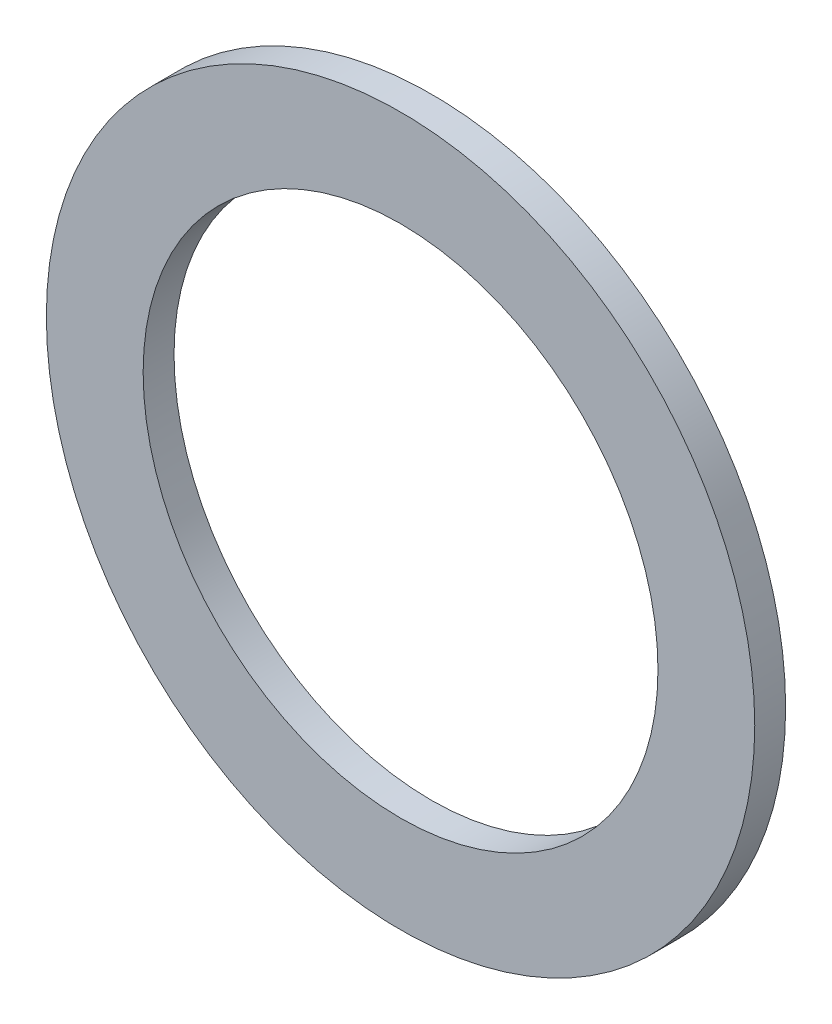
ISO-10303-21;
HEADER;
FILE_DESCRIPTION(('STEP AP214'),'2;1');
FILE_NAME('part.step','',(''),(''),'','','');
FILE_SCHEMA(('AUTOMOTIVE_DESIGN { 1 0 10303 214 1 1 1 1 }'));
ENDSEC;
DATA;
#1=APPLICATION_CONTEXT('core data for automotive mechanical design processes');
#2=APPLICATION_PROTOCOL_DEFINITION('international standard','automotive_design',2000,#1);
#3=PRODUCT_CONTEXT('',#1,'mechanical');
#4=PRODUCT('Part','Part','',(#3));
#5=PRODUCT_RELATED_PRODUCT_CATEGORY('part','',(#4));
#6=PRODUCT_DEFINITION_FORMATION('','',#4);
#7=PRODUCT_DEFINITION_CONTEXT('part definition',#1,'design');
#8=PRODUCT_DEFINITION('design','',#6,#7);
#9=PRODUCT_DEFINITION_SHAPE('','',#8);
#10=(LENGTH_UNIT() NAMED_UNIT(*) SI_UNIT(.MILLI.,.METRE.));
#11=(NAMED_UNIT(*) PLANE_ANGLE_UNIT() SI_UNIT($,.RADIAN.));
#12=(NAMED_UNIT(*) SI_UNIT($,.STERADIAN.) SOLID_ANGLE_UNIT());
#13=UNCERTAINTY_MEASURE_WITH_UNIT(LENGTH_MEASURE(1.E-05),#10,'distance_accuracy_value','');
#14=(GEOMETRIC_REPRESENTATION_CONTEXT(3) GLOBAL_UNCERTAINTY_ASSIGNED_CONTEXT((#13)) GLOBAL_UNIT_ASSIGNED_CONTEXT((#10,
#11,#12)) REPRESENTATION_CONTEXT('',''));
#15=CARTESIAN_POINT('',(0.,0.,0.));
#16=DIRECTION('',(0.,0.,1.));
#17=DIRECTION('',(1.,0.,0.));
#18=AXIS2_PLACEMENT_3D('',#15,#16,#17);
#19=CARTESIAN_POINT('',(0.,0.,0.761999999999929));
#20=DIRECTION('',(0.,0.,0.999999999999996));
#21=DIRECTION('',(0.999999999999995,0.,0.));
#22=AXIS2_PLACEMENT_3D('',#19,#20,#21);
#23=PLANE('',#22);
#24=CARTESIAN_POINT('',(0.,0.,0.761999999999929));
#25=DIRECTION('',(0.,0.,0.999999999999996));
#26=DIRECTION('',(0.999999999999995,0.,0.));
#27=AXIS2_PLACEMENT_3D('',#24,#25,#26);
#28=CIRCLE('',#27,8.7376);
#29=CARTESIAN_POINT('',(8.73759999999996,0.,0.761999999999929));
#30=VERTEX_POINT('',#29);
#31=EDGE_CURVE('E10',#30,#30,#28,.T.);
#32=ORIENTED_EDGE('',*,*,#31,.T.);
#33=EDGE_LOOP('',(#32));
#34=FACE_BOUND('',#33,.T.);
#35=CARTESIAN_POINT('',(0.,0.,0.761999999999929));
#36=DIRECTION('',(0.,0.,0.999999999999996));
#37=DIRECTION('',(0.999999999999995,0.,0.));
#38=AXIS2_PLACEMENT_3D('',#35,#36,#37);
#39=CIRCLE('',#38,6.35);
#40=CARTESIAN_POINT('',(6.34999999999997,0.,0.761999999999929));
#41=VERTEX_POINT('',#40);
#42=EDGE_CURVE('E48',#41,#41,#39,.T.);
#43=ORIENTED_EDGE('',*,*,#42,.F.);
#44=EDGE_LOOP('',(#43));
#45=FACE_BOUND('',#44,.T.);
#46=ADVANCED_FACE('F34',(#34,#45),#23,.T.);
#47=CARTESIAN_POINT('',(0.,0.,0.));
#48=DIRECTION('',(0.,0.,0.999999999999996));
#49=DIRECTION('',(0.999999999999995,0.,0.));
#50=AXIS2_PLACEMENT_3D('',#47,#48,#49);
#51=PLANE('',#50);
#52=CARTESIAN_POINT('',(0.,0.,0.));
#53=DIRECTION('',(0.,0.,0.999999999999996));
#54=DIRECTION('',(0.999999999999995,0.,0.));
#55=AXIS2_PLACEMENT_3D('',#52,#53,#54);
#56=CIRCLE('',#55,8.7376);
#57=CARTESIAN_POINT('',(8.73759999999996,0.,0.));
#58=VERTEX_POINT('',#57);
#59=EDGE_CURVE('E38',#58,#58,#56,.T.);
#60=ORIENTED_EDGE('',*,*,#59,.F.);
#61=EDGE_LOOP('',(#60));
#62=FACE_BOUND('',#61,.T.);
#63=CARTESIAN_POINT('',(0.,0.,0.));
#64=DIRECTION('',(0.,0.,0.999999999999996));
#65=DIRECTION('',(0.999999999999995,0.,0.));
#66=AXIS2_PLACEMENT_3D('',#63,#64,#65);
#67=CIRCLE('',#66,6.35);
#68=CARTESIAN_POINT('',(6.34999999999997,0.,0.));
#69=VERTEX_POINT('',#68);
#70=EDGE_CURVE('E50',#69,#69,#67,.T.);
#71=ORIENTED_EDGE('',*,*,#70,.T.);
#72=EDGE_LOOP('',(#71));
#73=FACE_BOUND('',#72,.T.);
#74=ADVANCED_FACE('F61',(#62,#73),#51,.F.);
#75=CARTESIAN_POINT('',(0.,0.,0.761999999999929));
#76=DIRECTION('',(0.,0.,-0.999999999999996));
#77=DIRECTION('',(-0.999999999999995,0.,0.));
#78=AXIS2_PLACEMENT_3D('',#75,#76,#77);
#79=CYLINDRICAL_SURFACE('',#78,8.7376);
#80=ORIENTED_EDGE('',*,*,#31,.F.);
#81=EDGE_LOOP('',(#80));
#82=FACE_BOUND('',#81,.T.);
#83=ORIENTED_EDGE('',*,*,#59,.T.);
#84=EDGE_LOOP('',(#83));
#85=FACE_BOUND('',#84,.T.);
#86=ADVANCED_FACE('F36',(#82,#85),#79,.T.);
#87=CARTESIAN_POINT('',(0.,0.,0.761999999999929));
#88=DIRECTION('',(0.,0.,-0.999999999999996));
#89=DIRECTION('',(-0.999999999999995,0.,0.));
#90=AXIS2_PLACEMENT_3D('',#87,#88,#89);
#91=CYLINDRICAL_SURFACE('',#90,6.35);
#92=ORIENTED_EDGE('',*,*,#42,.T.);
#93=EDGE_LOOP('',(#92));
#94=FACE_BOUND('',#93,.T.);
#95=ORIENTED_EDGE('',*,*,#70,.F.);
#96=EDGE_LOOP('',(#95));
#97=FACE_BOUND('',#96,.T.);
#98=ADVANCED_FACE('F57',(#94,#97),#91,.F.);
#99=CLOSED_SHELL('',(#46,#74,#86,#98));
#100=MANIFOLD_SOLID_BREP('B2',#99);
#101=ADVANCED_BREP_SHAPE_REPRESENTATION('',(#18,#100),#14);
#102=SHAPE_DEFINITION_REPRESENTATION(#9,#101);
ENDSEC;
END-ISO-10303-21;
